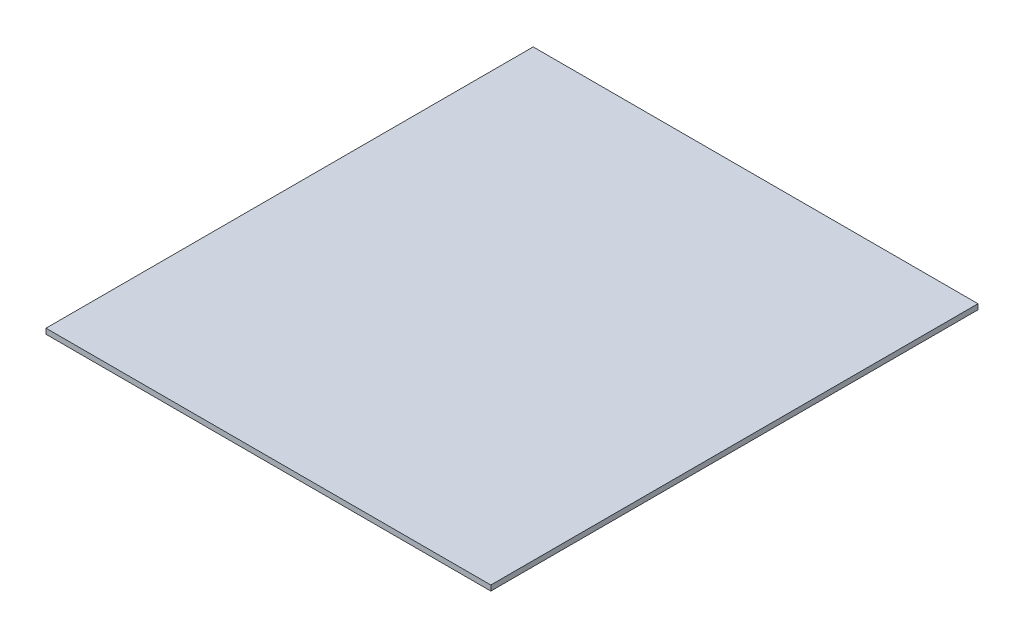
ISO-10303-21;
HEADER;
FILE_DESCRIPTION(('STEP AP214'),'2;1');
FILE_NAME('part.step','',(''),(''),'','','');
FILE_SCHEMA(('AUTOMOTIVE_DESIGN { 1 0 10303 214 1 1 1 1 }'));
ENDSEC;
DATA;
#1=APPLICATION_CONTEXT('core data for automotive mechanical design processes');
#2=APPLICATION_PROTOCOL_DEFINITION('international standard','automotive_design',2000,#1);
#3=PRODUCT_CONTEXT('',#1,'mechanical');
#4=PRODUCT('Part','Part','',(#3));
#5=PRODUCT_RELATED_PRODUCT_CATEGORY('part','',(#4));
#6=PRODUCT_DEFINITION_FORMATION('','',#4);
#7=PRODUCT_DEFINITION_CONTEXT('part definition',#1,'design');
#8=PRODUCT_DEFINITION('design','',#6,#7);
#9=PRODUCT_DEFINITION_SHAPE('','',#8);
#10=(LENGTH_UNIT() NAMED_UNIT(*) SI_UNIT(.MILLI.,.METRE.));
#11=(NAMED_UNIT(*) PLANE_ANGLE_UNIT() SI_UNIT($,.RADIAN.));
#12=(NAMED_UNIT(*) SI_UNIT($,.STERADIAN.) SOLID_ANGLE_UNIT());
#13=UNCERTAINTY_MEASURE_WITH_UNIT(LENGTH_MEASURE(1.E-05),#10,'distance_accuracy_value','');
#14=(GEOMETRIC_REPRESENTATION_CONTEXT(3) GLOBAL_UNCERTAINTY_ASSIGNED_CONTEXT((#13)) GLOBAL_UNIT_ASSIGNED_CONTEXT((#10,
#11,#12)) REPRESENTATION_CONTEXT('',''));
#15=CARTESIAN_POINT('',(0.,0.,0.));
#16=DIRECTION('',(0.,0.,1.));
#17=DIRECTION('',(1.,0.,0.));
#18=AXIS2_PLACEMENT_3D('',#15,#16,#17);
#19=CARTESIAN_POINT('',(0.,1.5875,0.));
#20=DIRECTION('',(1.,0.,0.));
#21=DIRECTION('',(0.,0.,-1.));
#22=AXIS2_PLACEMENT_3D('',#19,#20,#21);
#23=PLANE('',#22);
#24=DIRECTION('',(0.,0.,1.));
#25=VECTOR('',#24,1.);
#26=CARTESIAN_POINT('',(0.,0.,0.));
#27=LINE('',#26,#25);
#28=CARTESIAN_POINT('',(0.,0.,-146.05));
#29=VERTEX_POINT('',#28);
#30=CARTESIAN_POINT('',(0.,0.,0.));
#31=VERTEX_POINT('',#30);
#32=EDGE_CURVE('E96',#29,#31,#27,.T.);
#33=ORIENTED_EDGE('',*,*,#32,.T.);
#34=DIRECTION('',(0.,-1.,0.));
#35=VECTOR('',#34,1.);
#36=CARTESIAN_POINT('',(0.,1.5875,0.));
#37=LINE('',#36,#35);
#38=CARTESIAN_POINT('',(0.,1.5875,0.));
#39=VERTEX_POINT('',#38);
#40=EDGE_CURVE('E11',#39,#31,#37,.T.);
#41=ORIENTED_EDGE('',*,*,#40,.F.);
#42=DIRECTION('',(0.,0.,1.));
#43=VECTOR('',#42,1.);
#44=CARTESIAN_POINT('',(0.,1.5875,0.));
#45=LINE('',#44,#43);
#46=CARTESIAN_POINT('',(0.,1.5875,-146.05));
#47=VERTEX_POINT('',#46);
#48=EDGE_CURVE('E84',#47,#39,#45,.T.);
#49=ORIENTED_EDGE('',*,*,#48,.F.);
#50=DIRECTION('',(0.,-1.,0.));
#51=VECTOR('',#50,1.);
#52=CARTESIAN_POINT('',(0.,1.5875,-146.05));
#53=LINE('',#52,#51);
#54=EDGE_CURVE('E92',#47,#29,#53,.T.);
#55=ORIENTED_EDGE('',*,*,#54,.T.);
#56=EDGE_LOOP('',(#33,#41,#49,#55));
#57=FACE_BOUND('',#56,.T.);
#58=ADVANCED_FACE('F33',(#57),#23,.F.);
#59=CARTESIAN_POINT('',(0.,1.5875,0.));
#60=DIRECTION('',(0.,0.,-1.));
#61=DIRECTION('',(-1.,0.,0.));
#62=AXIS2_PLACEMENT_3D('',#59,#60,#61);
#63=PLANE('',#62);
#64=DIRECTION('',(1.,0.,0.));
#65=VECTOR('',#64,1.);
#66=CARTESIAN_POINT('',(0.,0.,0.));
#67=LINE('',#66,#65);
#68=CARTESIAN_POINT('',(133.35,0.,0.));
#69=VERTEX_POINT('',#68);
#70=EDGE_CURVE('E88',#31,#69,#67,.T.);
#71=ORIENTED_EDGE('',*,*,#70,.T.);
#72=DIRECTION('',(0.,-1.,0.));
#73=VECTOR('',#72,1.);
#74=CARTESIAN_POINT('',(133.35,1.5875,0.));
#75=LINE('',#74,#73);
#76=CARTESIAN_POINT('',(133.35,1.5875,0.));
#77=VERTEX_POINT('',#76);
#78=EDGE_CURVE('E41',#77,#69,#75,.T.);
#79=ORIENTED_EDGE('',*,*,#78,.F.);
#80=DIRECTION('',(1.,0.,0.));
#81=VECTOR('',#80,1.);
#82=CARTESIAN_POINT('',(0.,1.5875,0.));
#83=LINE('',#82,#81);
#84=EDGE_CURVE('E79',#39,#77,#83,.T.);
#85=ORIENTED_EDGE('',*,*,#84,.F.);
#86=ORIENTED_EDGE('',*,*,#40,.T.);
#87=EDGE_LOOP('',(#71,#79,#85,#86));
#88=FACE_BOUND('',#87,.T.);
#89=ADVANCED_FACE('F87',(#88),#63,.F.);
#90=CARTESIAN_POINT('',(133.35,1.5875,0.));
#91=DIRECTION('',(-1.,0.,0.));
#92=DIRECTION('',(0.,0.,1.));
#93=AXIS2_PLACEMENT_3D('',#90,#91,#92);
#94=PLANE('',#93);
#95=DIRECTION('',(0.,0.,-1.));
#96=VECTOR('',#95,1.);
#97=CARTESIAN_POINT('',(133.35,0.,0.));
#98=LINE('',#97,#96);
#99=CARTESIAN_POINT('',(133.35,0.,-146.05));
#100=VERTEX_POINT('',#99);
#101=EDGE_CURVE('E66',#69,#100,#98,.T.);
#102=ORIENTED_EDGE('',*,*,#101,.T.);
#103=DIRECTION('',(0.,-1.,0.));
#104=VECTOR('',#103,1.);
#105=CARTESIAN_POINT('',(133.35,1.5875,-146.05));
#106=LINE('',#105,#104);
#107=CARTESIAN_POINT('',(133.35,1.5875,-146.05));
#108=VERTEX_POINT('',#107);
#109=EDGE_CURVE('E89',#108,#100,#106,.T.);
#110=ORIENTED_EDGE('',*,*,#109,.F.);
#111=DIRECTION('',(0.,0.,-1.));
#112=VECTOR('',#111,1.);
#113=CARTESIAN_POINT('',(133.35,1.5875,0.));
#114=LINE('',#113,#112);
#115=EDGE_CURVE('E82',#77,#108,#114,.T.);
#116=ORIENTED_EDGE('',*,*,#115,.F.);
#117=ORIENTED_EDGE('',*,*,#78,.T.);
#118=EDGE_LOOP('',(#102,#110,#116,#117));
#119=FACE_BOUND('',#118,.T.);
#120=ADVANCED_FACE('F90',(#119),#94,.F.);
#121=CARTESIAN_POINT('',(0.,1.5875,-146.05));
#122=DIRECTION('',(0.,0.,1.));
#123=DIRECTION('',(1.,0.,0.));
#124=AXIS2_PLACEMENT_3D('',#121,#122,#123);
#125=PLANE('',#124);
#126=DIRECTION('',(-1.,0.,0.));
#127=VECTOR('',#126,1.);
#128=CARTESIAN_POINT('',(0.,0.,-146.05));
#129=LINE('',#128,#127);
#130=EDGE_CURVE('E72',#100,#29,#129,.T.);
#131=ORIENTED_EDGE('',*,*,#130,.T.);
#132=ORIENTED_EDGE('',*,*,#54,.F.);
#133=DIRECTION('',(-1.,0.,0.));
#134=VECTOR('',#133,1.);
#135=CARTESIAN_POINT('',(0.,1.5875,-146.05));
#136=LINE('',#135,#134);
#137=EDGE_CURVE('E49',#108,#47,#136,.T.);
#138=ORIENTED_EDGE('',*,*,#137,.F.);
#139=ORIENTED_EDGE('',*,*,#109,.T.);
#140=EDGE_LOOP('',(#131,#132,#138,#139));
#141=FACE_BOUND('',#140,.T.);
#142=ADVANCED_FACE('F103',(#141),#125,.F.);
#143=CARTESIAN_POINT('',(0.,1.5875,0.));
#144=DIRECTION('',(0.,-1.,0.));
#145=DIRECTION('',(0.,0.,-1.));
#146=AXIS2_PLACEMENT_3D('',#143,#144,#145);
#147=PLANE('',#146);
#148=ORIENTED_EDGE('',*,*,#48,.T.);
#149=ORIENTED_EDGE('',*,*,#84,.T.);
#150=ORIENTED_EDGE('',*,*,#115,.T.);
#151=ORIENTED_EDGE('',*,*,#137,.T.);
#152=EDGE_LOOP('',(#148,#149,#150,#151));
#153=FACE_BOUND('',#152,.T.);
#154=ADVANCED_FACE('F80',(#153),#147,.F.);
#155=CARTESIAN_POINT('',(0.,0.,0.));
#156=DIRECTION('',(0.,-1.,0.));
#157=DIRECTION('',(0.,0.,-1.));
#158=AXIS2_PLACEMENT_3D('',#155,#156,#157);
#159=PLANE('',#158);
#160=ORIENTED_EDGE('',*,*,#32,.F.);
#161=ORIENTED_EDGE('',*,*,#130,.F.);
#162=ORIENTED_EDGE('',*,*,#101,.F.);
#163=ORIENTED_EDGE('',*,*,#70,.F.);
#164=EDGE_LOOP('',(#160,#161,#162,#163));
#165=FACE_BOUND('',#164,.T.);
#166=ADVANCED_FACE('F106',(#165),#159,.T.);
#167=CLOSED_SHELL('',(#58,#89,#120,#142,#154,#166));
#168=MANIFOLD_SOLID_BREP('B2',#167);
#169=ADVANCED_BREP_SHAPE_REPRESENTATION('',(#18,#168),#14);
#170=SHAPE_DEFINITION_REPRESENTATION(#9,#169);
ENDSEC;
END-ISO-10303-21;
